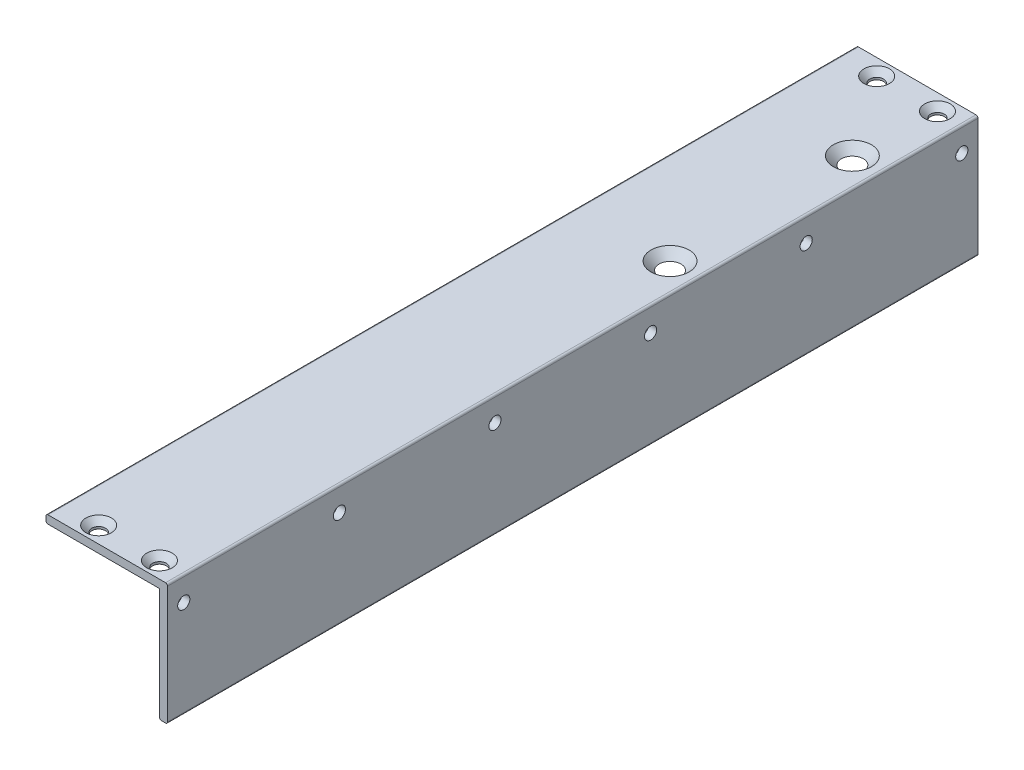
ISO-10303-21;
HEADER;
FILE_DESCRIPTION(('STEP AP214'),'2;1');
FILE_NAME('part.step','',(''),(''),'','','');
FILE_SCHEMA(('AUTOMOTIVE_DESIGN { 1 0 10303 214 1 1 1 1 }'));
ENDSEC;
DATA;
#1=APPLICATION_CONTEXT('core data for automotive mechanical design processes');
#2=APPLICATION_PROTOCOL_DEFINITION('international standard','automotive_design',2000,#1);
#3=PRODUCT_CONTEXT('',#1,'mechanical');
#4=PRODUCT('Part','Part','',(#3));
#5=PRODUCT_RELATED_PRODUCT_CATEGORY('part','',(#4));
#6=PRODUCT_DEFINITION_FORMATION('','',#4);
#7=PRODUCT_DEFINITION_CONTEXT('part definition',#1,'design');
#8=PRODUCT_DEFINITION('design','',#6,#7);
#9=PRODUCT_DEFINITION_SHAPE('','',#8);
#10=(LENGTH_UNIT() NAMED_UNIT(*) SI_UNIT(.MILLI.,.METRE.));
#11=(NAMED_UNIT(*) PLANE_ANGLE_UNIT() SI_UNIT($,.RADIAN.));
#12=(NAMED_UNIT(*) SI_UNIT($,.STERADIAN.) SOLID_ANGLE_UNIT());
#13=UNCERTAINTY_MEASURE_WITH_UNIT(LENGTH_MEASURE(1.E-05),#10,'distance_accuracy_value','');
#14=(GEOMETRIC_REPRESENTATION_CONTEXT(3) GLOBAL_UNCERTAINTY_ASSIGNED_CONTEXT((#13)) GLOBAL_UNIT_ASSIGNED_CONTEXT((#10,
#11,#12)) REPRESENTATION_CONTEXT('',''));
#15=CARTESIAN_POINT('',(0.,0.,0.));
#16=DIRECTION('',(0.,0.,1.));
#17=DIRECTION('',(1.,0.,0.));
#18=AXIS2_PLACEMENT_3D('',#15,#16,#17);
#19=CARTESIAN_POINT('',(2.,30.,200.));
#20=DIRECTION('',(-1.,0.,0.));
#21=DIRECTION('',(0.,-1.,0.));
#22=AXIS2_PLACEMENT_3D('',#19,#20,#21);
#23=PLANE('',#22);
#24=CARTESIAN_POINT('',(2.,24.,157.6));
#25=DIRECTION('',(1.,0.,0.));
#26=DIRECTION('',(0.,0.,-1.));
#27=AXIS2_PLACEMENT_3D('',#24,#25,#26);
#28=CIRCLE('',#27,1.49999999999999);
#29=CARTESIAN_POINT('',(2.,24.,156.1));
#30=VERTEX_POINT('',#29);
#31=EDGE_CURVE('E281',#30,#30,#28,.T.);
#32=ORIENTED_EDGE('',*,*,#31,.F.);
#33=EDGE_LOOP('',(#32));
#34=FACE_BOUND('',#33,.T.);
#35=CARTESIAN_POINT('',(2.,24.,80.8));
#36=DIRECTION('',(1.,0.,0.));
#37=DIRECTION('',(0.,0.,-1.));
#38=AXIS2_PLACEMENT_3D('',#35,#36,#37);
#39=CIRCLE('',#38,1.49999999999999);
#40=CARTESIAN_POINT('',(2.,24.,79.3));
#41=VERTEX_POINT('',#40);
#42=EDGE_CURVE('E269',#41,#41,#39,.T.);
#43=ORIENTED_EDGE('',*,*,#42,.F.);
#44=EDGE_LOOP('',(#43));
#45=FACE_BOUND('',#44,.T.);
#46=CARTESIAN_POINT('',(2.,24.,4.));
#47=DIRECTION('',(1.,0.,0.));
#48=DIRECTION('',(0.,0.,-1.));
#49=AXIS2_PLACEMENT_3D('',#46,#47,#48);
#50=CIRCLE('',#49,1.49999999999999);
#51=CARTESIAN_POINT('',(2.,24.,2.50000000000001));
#52=VERTEX_POINT('',#51);
#53=EDGE_CURVE('E257',#52,#52,#50,.T.);
#54=ORIENTED_EDGE('',*,*,#53,.F.);
#55=EDGE_LOOP('',(#54));
#56=FACE_BOUND('',#55,.T.);
#57=DIRECTION('',(0.,1.,0.));
#58=VECTOR('',#57,1.);
#59=CARTESIAN_POINT('',(2.,30.,200.));
#60=LINE('',#59,#58);
#61=CARTESIAN_POINT('',(2.,0.5,200.));
#62=VERTEX_POINT('',#61);
#63=CARTESIAN_POINT('',(2.,29.5,200.));
#64=VERTEX_POINT('',#63);
#65=EDGE_CURVE('E141',#62,#64,#60,.T.);
#66=ORIENTED_EDGE('',*,*,#65,.F.);
#67=DIRECTION('',(0.,0.,-1.));
#68=VECTOR('',#67,1.);
#69=CARTESIAN_POINT('',(2.,0.5,200.));
#70=LINE('',#69,#68);
#71=CARTESIAN_POINT('',(2.,0.5,0.));
#72=VERTEX_POINT('',#71);
#73=EDGE_CURVE('E181',#62,#72,#70,.T.);
#74=ORIENTED_EDGE('',*,*,#73,.T.);
#75=DIRECTION('',(0.,1.,0.));
#76=VECTOR('',#75,1.);
#77=CARTESIAN_POINT('',(2.,30.,0.));
#78=LINE('',#77,#76);
#79=CARTESIAN_POINT('',(2.,29.5,0.));
#80=VERTEX_POINT('',#79);
#81=EDGE_CURVE('E198',#72,#80,#78,.T.);
#82=ORIENTED_EDGE('',*,*,#81,.T.);
#83=DIRECTION('',(0.,0.,-1.));
#84=VECTOR('',#83,1.);
#85=CARTESIAN_POINT('',(2.,29.5,200.));
#86=LINE('',#85,#84);
#87=EDGE_CURVE('E179',#80,#64,#86,.F.);
#88=ORIENTED_EDGE('',*,*,#87,.T.);
#89=EDGE_LOOP('',(#66,#74,#82,#88));
#90=FACE_BOUND('',#89,.T.);
#91=CARTESIAN_POINT('',(2.,24.,42.4));
#92=DIRECTION('',(1.,0.,0.));
#93=DIRECTION('',(0.,0.,-1.));
#94=AXIS2_PLACEMENT_3D('',#91,#92,#93);
#95=CIRCLE('',#94,1.49999999999999);
#96=CARTESIAN_POINT('',(2.,24.,40.9));
#97=VERTEX_POINT('',#96);
#98=EDGE_CURVE('E263',#97,#97,#95,.T.);
#99=ORIENTED_EDGE('',*,*,#98,.F.);
#100=EDGE_LOOP('',(#99));
#101=FACE_BOUND('',#100,.T.);
#102=CARTESIAN_POINT('',(2.,24.,119.2));
#103=DIRECTION('',(1.,0.,0.));
#104=DIRECTION('',(0.,0.,-1.));
#105=AXIS2_PLACEMENT_3D('',#102,#103,#104);
#106=CIRCLE('',#105,1.49999999999999);
#107=CARTESIAN_POINT('',(2.,24.,117.7));
#108=VERTEX_POINT('',#107);
#109=EDGE_CURVE('E275',#108,#108,#106,.T.);
#110=ORIENTED_EDGE('',*,*,#109,.F.);
#111=EDGE_LOOP('',(#110));
#112=FACE_BOUND('',#111,.T.);
#113=CARTESIAN_POINT('',(2.,24.,196.));
#114=DIRECTION('',(1.,0.,0.));
#115=DIRECTION('',(0.,0.,-1.));
#116=AXIS2_PLACEMENT_3D('',#113,#114,#115);
#117=CIRCLE('',#116,1.49999999999999);
#118=CARTESIAN_POINT('',(2.,24.,194.5));
#119=VERTEX_POINT('',#118);
#120=EDGE_CURVE('E287',#119,#119,#117,.T.);
#121=ORIENTED_EDGE('',*,*,#120,.F.);
#122=EDGE_LOOP('',(#121));
#123=FACE_BOUND('',#122,.T.);
#124=ADVANCED_FACE('F31',(#34,#45,#56,#90,#101,#112,#123),#23,.F.);
#125=CARTESIAN_POINT('',(-28.,30.,200.));
#126=DIRECTION('',(0.,-1.,0.));
#127=DIRECTION('',(1.,0.,0.));
#128=AXIS2_PLACEMENT_3D('',#125,#126,#127);
#129=PLANE('',#128);
#130=CARTESIAN_POINT('',(-4.,30.,196.));
#131=DIRECTION('',(0.,1.,0.));
#132=DIRECTION('',(0.,0.,1.));
#133=AXIS2_PLACEMENT_3D('',#130,#131,#132);
#134=CIRCLE('',#133,3.15);
#135=CARTESIAN_POINT('',(-4.,30.,199.15));
#136=VERTEX_POINT('',#135);
#137=EDGE_CURVE('E242',#136,#136,#134,.T.);
#138=ORIENTED_EDGE('',*,*,#137,.F.);
#139=EDGE_LOOP('',(#138));
#140=FACE_BOUND('',#139,.T.);
#141=CARTESIAN_POINT('',(-4.,30.,4.));
#142=DIRECTION('',(0.,1.,0.));
#143=DIRECTION('',(0.,0.,1.));
#144=AXIS2_PLACEMENT_3D('',#141,#142,#143);
#145=CIRCLE('',#144,3.15);
#146=CARTESIAN_POINT('',(-4.,30.,7.15));
#147=VERTEX_POINT('',#146);
#148=EDGE_CURVE('E224',#147,#147,#145,.T.);
#149=ORIENTED_EDGE('',*,*,#148,.F.);
#150=EDGE_LOOP('',(#149));
#151=FACE_BOUND('',#150,.T.);
#152=CARTESIAN_POINT('',(-5.,30.,24.));
#153=DIRECTION('',(0.,1.,0.));
#154=DIRECTION('',(0.,0.,1.));
#155=AXIS2_PLACEMENT_3D('',#152,#153,#154);
#156=CIRCLE('',#155,4.7);
#157=CARTESIAN_POINT('',(-5.,30.,28.7));
#158=VERTEX_POINT('',#157);
#159=EDGE_CURVE('E209',#158,#158,#156,.T.);
#160=ORIENTED_EDGE('',*,*,#159,.F.);
#161=EDGE_LOOP('',(#160));
#162=FACE_BOUND('',#161,.T.);
#163=DIRECTION('',(-1.,0.,0.));
#164=VECTOR('',#163,1.);
#165=CARTESIAN_POINT('',(-28.,30.,200.));
#166=LINE('',#165,#164);
#167=CARTESIAN_POINT('',(1.5,30.,200.));
#168=VERTEX_POINT('',#167);
#169=CARTESIAN_POINT('',(-27.5,30.,200.));
#170=VERTEX_POINT('',#169);
#171=EDGE_CURVE('E147',#168,#170,#166,.T.);
#172=ORIENTED_EDGE('',*,*,#171,.F.);
#173=DIRECTION('',(0.,0.,-1.));
#174=VECTOR('',#173,1.);
#175=CARTESIAN_POINT('',(1.5,30.,200.));
#176=LINE('',#175,#174);
#177=CARTESIAN_POINT('',(1.5,30.,0.));
#178=VERTEX_POINT('',#177);
#179=EDGE_CURVE('E186',#168,#178,#176,.T.);
#180=ORIENTED_EDGE('',*,*,#179,.T.);
#181=DIRECTION('',(-1.,0.,0.));
#182=VECTOR('',#181,1.);
#183=CARTESIAN_POINT('',(-28.,30.,0.));
#184=LINE('',#183,#182);
#185=CARTESIAN_POINT('',(-27.5,30.,0.));
#186=VERTEX_POINT('',#185);
#187=EDGE_CURVE('E197',#178,#186,#184,.T.);
#188=ORIENTED_EDGE('',*,*,#187,.T.);
#189=DIRECTION('',(0.,0.,-1.));
#190=VECTOR('',#189,1.);
#191=CARTESIAN_POINT('',(-27.5,30.,200.));
#192=LINE('',#191,#190);
#193=EDGE_CURVE('E184',#186,#170,#192,.F.);
#194=ORIENTED_EDGE('',*,*,#193,.T.);
#195=EDGE_LOOP('',(#172,#180,#188,#194));
#196=FACE_BOUND('',#195,.T.);
#197=CARTESIAN_POINT('',(-5.,30.,69.));
#198=DIRECTION('',(0.,1.,0.));
#199=DIRECTION('',(0.,0.,1.));
#200=AXIS2_PLACEMENT_3D('',#197,#198,#199);
#201=CIRCLE('',#200,4.7);
#202=CARTESIAN_POINT('',(-5.,30.,73.7));
#203=VERTEX_POINT('',#202);
#204=EDGE_CURVE('E215',#203,#203,#201,.T.);
#205=ORIENTED_EDGE('',*,*,#204,.F.);
#206=EDGE_LOOP('',(#205));
#207=FACE_BOUND('',#206,.T.);
#208=CARTESIAN_POINT('',(-19.,30.,4.));
#209=DIRECTION('',(0.,1.,0.));
#210=DIRECTION('',(0.,0.,1.));
#211=AXIS2_PLACEMENT_3D('',#208,#209,#210);
#212=CIRCLE('',#211,3.15);
#213=CARTESIAN_POINT('',(-19.,30.,7.15));
#214=VERTEX_POINT('',#213);
#215=EDGE_CURVE('E233',#214,#214,#212,.T.);
#216=ORIENTED_EDGE('',*,*,#215,.F.);
#217=EDGE_LOOP('',(#216));
#218=FACE_BOUND('',#217,.T.);
#219=CARTESIAN_POINT('',(-19.,30.,196.));
#220=DIRECTION('',(0.,1.,0.));
#221=DIRECTION('',(0.,0.,1.));
#222=AXIS2_PLACEMENT_3D('',#219,#220,#221);
#223=CIRCLE('',#222,3.15);
#224=CARTESIAN_POINT('',(-19.,30.,199.15));
#225=VERTEX_POINT('',#224);
#226=EDGE_CURVE('E251',#225,#225,#223,.T.);
#227=ORIENTED_EDGE('',*,*,#226,.F.);
#228=EDGE_LOOP('',(#227));
#229=FACE_BOUND('',#228,.T.);
#230=ADVANCED_FACE('F294',(#140,#151,#162,#196,#207,#218,#229),#129,.F.);
#231=CARTESIAN_POINT('',(2.,0.,200.));
#232=DIRECTION('',(0.,1.,0.));
#233=DIRECTION('',(-1.,0.,0.));
#234=AXIS2_PLACEMENT_3D('',#231,#232,#233);
#235=PLANE('',#234);
#236=DIRECTION('',(1.,0.,0.));
#237=VECTOR('',#236,1.);
#238=CARTESIAN_POINT('',(2.,0.,200.));
#239=LINE('',#238,#237);
#240=CARTESIAN_POINT('',(0.5,0.,200.));
#241=VERTEX_POINT('',#240);
#242=CARTESIAN_POINT('',(1.5,0.,200.));
#243=VERTEX_POINT('',#242);
#244=EDGE_CURVE('E138',#241,#243,#239,.T.);
#245=ORIENTED_EDGE('',*,*,#244,.F.);
#246=DIRECTION('',(0.,0.,-1.));
#247=VECTOR('',#246,1.);
#248=CARTESIAN_POINT('',(0.5,0.,200.));
#249=LINE('',#248,#247);
#250=CARTESIAN_POINT('',(0.5,0.,0.));
#251=VERTEX_POINT('',#250);
#252=EDGE_CURVE('E156',#241,#251,#249,.T.);
#253=ORIENTED_EDGE('',*,*,#252,.T.);
#254=DIRECTION('',(1.,0.,0.));
#255=VECTOR('',#254,1.);
#256=CARTESIAN_POINT('',(2.,0.,0.));
#257=LINE('',#256,#255);
#258=CARTESIAN_POINT('',(1.5,0.,0.));
#259=VERTEX_POINT('',#258);
#260=EDGE_CURVE('E203',#251,#259,#257,.T.);
#261=ORIENTED_EDGE('',*,*,#260,.T.);
#262=DIRECTION('',(0.,0.,-1.));
#263=VECTOR('',#262,1.);
#264=CARTESIAN_POINT('',(1.5,0.,200.));
#265=LINE('',#264,#263);
#266=EDGE_CURVE('E133',#259,#243,#265,.F.);
#267=ORIENTED_EDGE('',*,*,#266,.T.);
#268=EDGE_LOOP('',(#245,#253,#261,#267));
#269=FACE_BOUND('',#268,.T.);
#270=ADVANCED_FACE('F33',(#269),#235,.F.);
#271=CARTESIAN_POINT('',(-28.,28.,200.));
#272=DIRECTION('',(1.,0.,0.));
#273=DIRECTION('',(0.,0.,-1.));
#274=AXIS2_PLACEMENT_3D('',#271,#272,#273);
#275=PLANE('',#274);
#276=DIRECTION('',(0.,-1.,0.));
#277=VECTOR('',#276,1.);
#278=CARTESIAN_POINT('',(-28.,28.,200.));
#279=LINE('',#278,#277);
#280=CARTESIAN_POINT('',(-28.,29.5,200.));
#281=VERTEX_POINT('',#280);
#282=CARTESIAN_POINT('',(-28.,28.5,200.));
#283=VERTEX_POINT('',#282);
#284=EDGE_CURVE('E150',#281,#283,#279,.T.);
#285=ORIENTED_EDGE('',*,*,#284,.F.);
#286=DIRECTION('',(0.,0.,-1.));
#287=VECTOR('',#286,1.);
#288=CARTESIAN_POINT('',(-28.,29.5,200.));
#289=LINE('',#288,#287);
#290=CARTESIAN_POINT('',(-28.,29.5,0.));
#291=VERTEX_POINT('',#290);
#292=EDGE_CURVE('E39',#281,#291,#289,.T.);
#293=ORIENTED_EDGE('',*,*,#292,.T.);
#294=DIRECTION('',(0.,-1.,0.));
#295=VECTOR('',#294,1.);
#296=CARTESIAN_POINT('',(-28.,28.,0.));
#297=LINE('',#296,#295);
#298=CARTESIAN_POINT('',(-28.,28.5,0.));
#299=VERTEX_POINT('',#298);
#300=EDGE_CURVE('E125',#291,#299,#297,.T.);
#301=ORIENTED_EDGE('',*,*,#300,.T.);
#302=DIRECTION('',(0.,0.,-1.));
#303=VECTOR('',#302,1.);
#304=CARTESIAN_POINT('',(-28.,28.5,200.));
#305=LINE('',#304,#303);
#306=EDGE_CURVE('E54',#299,#283,#305,.F.);
#307=ORIENTED_EDGE('',*,*,#306,.T.);
#308=EDGE_LOOP('',(#285,#293,#301,#307));
#309=FACE_BOUND('',#308,.T.);
#310=ADVANCED_FACE('F192',(#309),#275,.F.);
#311=CARTESIAN_POINT('',(0.,28.,200.));
#312=DIRECTION('',(0.,1.,0.));
#313=DIRECTION('',(-1.,0.,0.));
#314=AXIS2_PLACEMENT_3D('',#311,#312,#313);
#315=PLANE('',#314);
#316=CARTESIAN_POINT('',(-19.,28.,196.));
#317=DIRECTION('',(0.,1.,0.));
#318=DIRECTION('',(-1.,0.,0.));
#319=AXIS2_PLACEMENT_3D('',#316,#317,#318);
#320=CIRCLE('',#319,1.69999999999999);
#321=CARTESIAN_POINT('',(-20.7,28.,196.));
#322=VERTEX_POINT('',#321);
#323=EDGE_CURVE('E245',#322,#322,#320,.T.);
#324=ORIENTED_EDGE('',*,*,#323,.T.);
#325=EDGE_LOOP('',(#324));
#326=FACE_BOUND('',#325,.T.);
#327=CARTESIAN_POINT('',(-4.,28.,196.));
#328=DIRECTION('',(0.,1.,0.));
#329=DIRECTION('',(-1.,0.,0.));
#330=AXIS2_PLACEMENT_3D('',#327,#328,#329);
#331=CIRCLE('',#330,1.69999999999999);
#332=CARTESIAN_POINT('',(-5.7,28.,196.));
#333=VERTEX_POINT('',#332);
#334=EDGE_CURVE('E236',#333,#333,#331,.T.);
#335=ORIENTED_EDGE('',*,*,#334,.T.);
#336=EDGE_LOOP('',(#335));
#337=FACE_BOUND('',#336,.T.);
#338=CARTESIAN_POINT('',(-19.,28.,4.));
#339=DIRECTION('',(0.,1.,0.));
#340=DIRECTION('',(-1.,0.,0.));
#341=AXIS2_PLACEMENT_3D('',#338,#339,#340);
#342=CIRCLE('',#341,1.7);
#343=CARTESIAN_POINT('',(-20.7,28.,4.));
#344=VERTEX_POINT('',#343);
#345=EDGE_CURVE('E227',#344,#344,#342,.T.);
#346=ORIENTED_EDGE('',*,*,#345,.T.);
#347=EDGE_LOOP('',(#346));
#348=FACE_BOUND('',#347,.T.);
#349=CARTESIAN_POINT('',(-4.,28.,4.));
#350=DIRECTION('',(0.,1.,0.));
#351=DIRECTION('',(-1.,0.,0.));
#352=AXIS2_PLACEMENT_3D('',#349,#350,#351);
#353=CIRCLE('',#352,1.7);
#354=CARTESIAN_POINT('',(-5.7,28.,4.));
#355=VERTEX_POINT('',#354);
#356=EDGE_CURVE('E218',#355,#355,#353,.T.);
#357=ORIENTED_EDGE('',*,*,#356,.T.);
#358=EDGE_LOOP('',(#357));
#359=FACE_BOUND('',#358,.T.);
#360=CARTESIAN_POINT('',(-5.,28.,69.));
#361=DIRECTION('',(0.,1.,0.));
#362=DIRECTION('',(-1.,0.,0.));
#363=AXIS2_PLACEMENT_3D('',#360,#361,#362);
#364=CIRCLE('',#363,2.7);
#365=CARTESIAN_POINT('',(-7.70000000000001,28.,69.));
#366=VERTEX_POINT('',#365);
#367=EDGE_CURVE('E212',#366,#366,#364,.T.);
#368=ORIENTED_EDGE('',*,*,#367,.T.);
#369=EDGE_LOOP('',(#368));
#370=FACE_BOUND('',#369,.T.);
#371=CARTESIAN_POINT('',(-5.,28.,24.));
#372=DIRECTION('',(0.,1.,0.));
#373=DIRECTION('',(-1.,0.,0.));
#374=AXIS2_PLACEMENT_3D('',#371,#372,#373);
#375=CIRCLE('',#374,2.7);
#376=CARTESIAN_POINT('',(-7.70000000000001,28.,24.));
#377=VERTEX_POINT('',#376);
#378=EDGE_CURVE('E206',#377,#377,#375,.T.);
#379=ORIENTED_EDGE('',*,*,#378,.T.);
#380=EDGE_LOOP('',(#379));
#381=FACE_BOUND('',#380,.T.);
#382=DIRECTION('',(1.,0.,0.));
#383=VECTOR('',#382,1.);
#384=CARTESIAN_POINT('',(0.,28.,200.));
#385=LINE('',#384,#383);
#386=CARTESIAN_POINT('',(-27.5,28.,200.));
#387=VERTEX_POINT('',#386);
#388=CARTESIAN_POINT('',(0.,28.,200.));
#389=VERTEX_POINT('',#388);
#390=EDGE_CURVE('E152',#387,#389,#385,.T.);
#391=ORIENTED_EDGE('',*,*,#390,.F.);
#392=DIRECTION('',(0.,0.,-1.));
#393=VECTOR('',#392,1.);
#394=CARTESIAN_POINT('',(-27.5,28.,200.));
#395=LINE('',#394,#393);
#396=CARTESIAN_POINT('',(-27.5,28.,0.));
#397=VERTEX_POINT('',#396);
#398=EDGE_CURVE('E11',#387,#397,#395,.T.);
#399=ORIENTED_EDGE('',*,*,#398,.T.);
#400=DIRECTION('',(1.,0.,0.));
#401=VECTOR('',#400,1.);
#402=CARTESIAN_POINT('',(0.,28.,0.));
#403=LINE('',#402,#401);
#404=CARTESIAN_POINT('',(0.,28.,0.));
#405=VERTEX_POINT('',#404);
#406=EDGE_CURVE('E116',#397,#405,#403,.T.);
#407=ORIENTED_EDGE('',*,*,#406,.T.);
#408=DIRECTION('',(0.,0.,-1.));
#409=VECTOR('',#408,1.);
#410=CARTESIAN_POINT('',(0.,28.,200.));
#411=LINE('',#410,#409);
#412=EDGE_CURVE('E119',#389,#405,#411,.T.);
#413=ORIENTED_EDGE('',*,*,#412,.F.);
#414=EDGE_LOOP('',(#391,#399,#407,#413));
#415=FACE_BOUND('',#414,.T.);
#416=ADVANCED_FACE('F118',(#326,#337,#348,#359,#370,#381,#415),#315,.F.);
#417=CARTESIAN_POINT('',(0.,0.,200.));
#418=DIRECTION('',(1.,0.,0.));
#419=DIRECTION('',(0.,1.,0.));
#420=AXIS2_PLACEMENT_3D('',#417,#418,#419);
#421=PLANE('',#420);
#422=CARTESIAN_POINT('',(0.,24.,196.));
#423=DIRECTION('',(1.,0.,0.));
#424=DIRECTION('',(0.,1.,0.));
#425=AXIS2_PLACEMENT_3D('',#422,#423,#424);
#426=CIRCLE('',#425,1.49999999999999);
#427=CARTESIAN_POINT('',(0.,25.5,196.));
#428=VERTEX_POINT('',#427);
#429=EDGE_CURVE('E284',#428,#428,#426,.T.);
#430=ORIENTED_EDGE('',*,*,#429,.T.);
#431=EDGE_LOOP('',(#430));
#432=FACE_BOUND('',#431,.T.);
#433=CARTESIAN_POINT('',(0.,24.,157.6));
#434=DIRECTION('',(1.,0.,0.));
#435=DIRECTION('',(0.,1.,0.));
#436=AXIS2_PLACEMENT_3D('',#433,#434,#435);
#437=CIRCLE('',#436,1.49999999999999);
#438=CARTESIAN_POINT('',(0.,25.5,157.6));
#439=VERTEX_POINT('',#438);
#440=EDGE_CURVE('E278',#439,#439,#437,.T.);
#441=ORIENTED_EDGE('',*,*,#440,.T.);
#442=EDGE_LOOP('',(#441));
#443=FACE_BOUND('',#442,.T.);
#444=CARTESIAN_POINT('',(0.,24.,119.2));
#445=DIRECTION('',(1.,0.,0.));
#446=DIRECTION('',(0.,1.,0.));
#447=AXIS2_PLACEMENT_3D('',#444,#445,#446);
#448=CIRCLE('',#447,1.49999999999999);
#449=CARTESIAN_POINT('',(0.,25.5,119.2));
#450=VERTEX_POINT('',#449);
#451=EDGE_CURVE('E272',#450,#450,#448,.T.);
#452=ORIENTED_EDGE('',*,*,#451,.T.);
#453=EDGE_LOOP('',(#452));
#454=FACE_BOUND('',#453,.T.);
#455=CARTESIAN_POINT('',(0.,24.,80.8));
#456=DIRECTION('',(1.,0.,0.));
#457=DIRECTION('',(0.,1.,0.));
#458=AXIS2_PLACEMENT_3D('',#455,#456,#457);
#459=CIRCLE('',#458,1.49999999999999);
#460=CARTESIAN_POINT('',(0.,25.5,80.8));
#461=VERTEX_POINT('',#460);
#462=EDGE_CURVE('E266',#461,#461,#459,.T.);
#463=ORIENTED_EDGE('',*,*,#462,.T.);
#464=EDGE_LOOP('',(#463));
#465=FACE_BOUND('',#464,.T.);
#466=CARTESIAN_POINT('',(0.,24.,42.4));
#467=DIRECTION('',(1.,0.,0.));
#468=DIRECTION('',(0.,1.,0.));
#469=AXIS2_PLACEMENT_3D('',#466,#467,#468);
#470=CIRCLE('',#469,1.49999999999999);
#471=CARTESIAN_POINT('',(0.,25.5,42.4));
#472=VERTEX_POINT('',#471);
#473=EDGE_CURVE('E260',#472,#472,#470,.T.);
#474=ORIENTED_EDGE('',*,*,#473,.T.);
#475=EDGE_LOOP('',(#474));
#476=FACE_BOUND('',#475,.T.);
#477=CARTESIAN_POINT('',(0.,24.,4.));
#478=DIRECTION('',(1.,0.,0.));
#479=DIRECTION('',(0.,1.,0.));
#480=AXIS2_PLACEMENT_3D('',#477,#478,#479);
#481=CIRCLE('',#480,1.49999999999999);
#482=CARTESIAN_POINT('',(0.,25.5,4.));
#483=VERTEX_POINT('',#482);
#484=EDGE_CURVE('E254',#483,#483,#481,.T.);
#485=ORIENTED_EDGE('',*,*,#484,.T.);
#486=EDGE_LOOP('',(#485));
#487=FACE_BOUND('',#486,.T.);
#488=DIRECTION('',(0.,-1.,0.));
#489=VECTOR('',#488,1.);
#490=CARTESIAN_POINT('',(0.,0.,0.));
#491=LINE('',#490,#489);
#492=CARTESIAN_POINT('',(0.,0.5,0.));
#493=VERTEX_POINT('',#492);
#494=EDGE_CURVE('E124',#405,#493,#491,.T.);
#495=ORIENTED_EDGE('',*,*,#494,.T.);
#496=DIRECTION('',(0.,0.,-1.));
#497=VECTOR('',#496,1.);
#498=CARTESIAN_POINT('',(0.,0.5,200.));
#499=LINE('',#498,#497);
#500=CARTESIAN_POINT('',(0.,0.5,200.));
#501=VERTEX_POINT('',#500);
#502=EDGE_CURVE('E168',#493,#501,#499,.F.);
#503=ORIENTED_EDGE('',*,*,#502,.T.);
#504=DIRECTION('',(0.,-1.,0.));
#505=VECTOR('',#504,1.);
#506=CARTESIAN_POINT('',(0.,0.,200.));
#507=LINE('',#506,#505);
#508=EDGE_CURVE('E132',#389,#501,#507,.T.);
#509=ORIENTED_EDGE('',*,*,#508,.F.);
#510=ORIENTED_EDGE('',*,*,#412,.T.);
#511=EDGE_LOOP('',(#495,#503,#509,#510));
#512=FACE_BOUND('',#511,.T.);
#513=ADVANCED_FACE('F129',(#432,#443,#454,#465,#476,#487,#512),#421,.F.);
#514=CARTESIAN_POINT('',(0.,0.,200.));
#515=DIRECTION('',(0.,0.,-1.));
#516=DIRECTION('',(-1.,0.,0.));
#517=AXIS2_PLACEMENT_3D('',#514,#515,#516);
#518=PLANE('',#517);
#519=ORIENTED_EDGE('',*,*,#508,.T.);
#520=CARTESIAN_POINT('',(0.5,0.5,200.));
#521=DIRECTION('',(0.,0.,-1.));
#522=DIRECTION('',(-1.,0.,0.));
#523=AXIS2_PLACEMENT_3D('',#520,#521,#522);
#524=CIRCLE('',#523,0.5);
#525=EDGE_CURVE('E177',#501,#241,#524,.F.);
#526=ORIENTED_EDGE('',*,*,#525,.T.);
#527=ORIENTED_EDGE('',*,*,#244,.T.);
#528=CARTESIAN_POINT('',(1.5,0.5,200.));
#529=DIRECTION('',(0.,0.,-1.));
#530=DIRECTION('',(-1.,0.,0.));
#531=AXIS2_PLACEMENT_3D('',#528,#529,#530);
#532=CIRCLE('',#531,0.5);
#533=EDGE_CURVE('E175',#243,#62,#532,.F.);
#534=ORIENTED_EDGE('',*,*,#533,.T.);
#535=ORIENTED_EDGE('',*,*,#65,.T.);
#536=CARTESIAN_POINT('',(1.5,29.5,200.));
#537=DIRECTION('',(0.,0.,-1.));
#538=DIRECTION('',(-1.,0.,0.));
#539=AXIS2_PLACEMENT_3D('',#536,#537,#538);
#540=CIRCLE('',#539,0.5);
#541=EDGE_CURVE('E173',#64,#168,#540,.F.);
#542=ORIENTED_EDGE('',*,*,#541,.T.);
#543=ORIENTED_EDGE('',*,*,#171,.T.);
#544=CARTESIAN_POINT('',(-27.5,29.5,200.));
#545=DIRECTION('',(0.,0.,-1.));
#546=DIRECTION('',(-1.,0.,0.));
#547=AXIS2_PLACEMENT_3D('',#544,#545,#546);
#548=CIRCLE('',#547,0.5);
#549=EDGE_CURVE('E171',#170,#281,#548,.F.);
#550=ORIENTED_EDGE('',*,*,#549,.T.);
#551=ORIENTED_EDGE('',*,*,#284,.T.);
#552=CARTESIAN_POINT('',(-27.5,28.5,200.));
#553=DIRECTION('',(0.,0.,-1.));
#554=DIRECTION('',(-1.,0.,0.));
#555=AXIS2_PLACEMENT_3D('',#552,#553,#554);
#556=CIRCLE('',#555,0.5);
#557=EDGE_CURVE('E46',#283,#387,#556,.F.);
#558=ORIENTED_EDGE('',*,*,#557,.T.);
#559=ORIENTED_EDGE('',*,*,#390,.T.);
#560=EDGE_LOOP('',(#519,#526,#527,#534,#535,#542,#543,#550,#551,#558,#559));
#561=FACE_BOUND('',#560,.T.);
#562=ADVANCED_FACE('F311',(#561),#518,.F.);
#563=CARTESIAN_POINT('',(0.,0.,0.));
#564=DIRECTION('',(0.,0.,-1.));
#565=DIRECTION('',(-1.,0.,0.));
#566=AXIS2_PLACEMENT_3D('',#563,#564,#565);
#567=PLANE('',#566);
#568=ORIENTED_EDGE('',*,*,#260,.F.);
#569=CARTESIAN_POINT('',(0.5,0.5,0.));
#570=DIRECTION('',(0.,0.,-1.));
#571=DIRECTION('',(-1.,0.,0.));
#572=AXIS2_PLACEMENT_3D('',#569,#570,#571);
#573=CIRCLE('',#572,0.5);
#574=EDGE_CURVE('E137',#251,#493,#573,.T.);
#575=ORIENTED_EDGE('',*,*,#574,.T.);
#576=ORIENTED_EDGE('',*,*,#494,.F.);
#577=ORIENTED_EDGE('',*,*,#406,.F.);
#578=CARTESIAN_POINT('',(-27.5,28.5,0.));
#579=DIRECTION('',(0.,0.,-1.));
#580=DIRECTION('',(-1.,0.,0.));
#581=AXIS2_PLACEMENT_3D('',#578,#579,#580);
#582=CIRCLE('',#581,0.5);
#583=EDGE_CURVE('E159',#397,#299,#582,.T.);
#584=ORIENTED_EDGE('',*,*,#583,.T.);
#585=ORIENTED_EDGE('',*,*,#300,.F.);
#586=CARTESIAN_POINT('',(-27.5,29.5,0.));
#587=DIRECTION('',(0.,0.,-1.));
#588=DIRECTION('',(-1.,0.,0.));
#589=AXIS2_PLACEMENT_3D('',#586,#587,#588);
#590=CIRCLE('',#589,0.5);
#591=EDGE_CURVE('E161',#291,#186,#590,.T.);
#592=ORIENTED_EDGE('',*,*,#591,.T.);
#593=ORIENTED_EDGE('',*,*,#187,.F.);
#594=CARTESIAN_POINT('',(1.5,29.5,0.));
#595=DIRECTION('',(0.,0.,-1.));
#596=DIRECTION('',(-1.,0.,0.));
#597=AXIS2_PLACEMENT_3D('',#594,#595,#596);
#598=CIRCLE('',#597,0.5);
#599=EDGE_CURVE('E163',#178,#80,#598,.T.);
#600=ORIENTED_EDGE('',*,*,#599,.T.);
#601=ORIENTED_EDGE('',*,*,#81,.F.);
#602=CARTESIAN_POINT('',(1.5,0.5,0.));
#603=DIRECTION('',(0.,0.,-1.));
#604=DIRECTION('',(-1.,0.,0.));
#605=AXIS2_PLACEMENT_3D('',#602,#603,#604);
#606=CIRCLE('',#605,0.5);
#607=EDGE_CURVE('E165',#72,#259,#606,.T.);
#608=ORIENTED_EDGE('',*,*,#607,.T.);
#609=EDGE_LOOP('',(#568,#575,#576,#577,#584,#585,#592,#593,#600,#601,#608));
#610=FACE_BOUND('',#609,.T.);
#611=ADVANCED_FACE('F136',(#610),#567,.T.);
#612=CARTESIAN_POINT('',(0.5,0.5,200.));
#613=DIRECTION('',(0.,0.,-1.));
#614=DIRECTION('',(-1.,0.,0.));
#615=AXIS2_PLACEMENT_3D('',#612,#613,#614);
#616=CYLINDRICAL_SURFACE('',#615,0.5);
#617=ORIENTED_EDGE('',*,*,#525,.F.);
#618=ORIENTED_EDGE('',*,*,#502,.F.);
#619=ORIENTED_EDGE('',*,*,#574,.F.);
#620=ORIENTED_EDGE('',*,*,#252,.F.);
#621=EDGE_LOOP('',(#617,#618,#619,#620));
#622=FACE_BOUND('',#621,.T.);
#623=ADVANCED_FACE('F317',(#622),#616,.T.);
#624=CARTESIAN_POINT('',(1.5,0.5,200.));
#625=DIRECTION('',(0.,0.,-1.));
#626=DIRECTION('',(-1.,0.,0.));
#627=AXIS2_PLACEMENT_3D('',#624,#625,#626);
#628=CYLINDRICAL_SURFACE('',#627,0.5);
#629=ORIENTED_EDGE('',*,*,#533,.F.);
#630=ORIENTED_EDGE('',*,*,#266,.F.);
#631=ORIENTED_EDGE('',*,*,#607,.F.);
#632=ORIENTED_EDGE('',*,*,#73,.F.);
#633=EDGE_LOOP('',(#629,#630,#631,#632));
#634=FACE_BOUND('',#633,.T.);
#635=ADVANCED_FACE('F320',(#634),#628,.T.);
#636=CARTESIAN_POINT('',(1.5,29.5,200.));
#637=DIRECTION('',(0.,0.,-1.));
#638=DIRECTION('',(-1.,0.,0.));
#639=AXIS2_PLACEMENT_3D('',#636,#637,#638);
#640=CYLINDRICAL_SURFACE('',#639,0.5);
#641=ORIENTED_EDGE('',*,*,#541,.F.);
#642=ORIENTED_EDGE('',*,*,#87,.F.);
#643=ORIENTED_EDGE('',*,*,#599,.F.);
#644=ORIENTED_EDGE('',*,*,#179,.F.);
#645=EDGE_LOOP('',(#641,#642,#643,#644));
#646=FACE_BOUND('',#645,.T.);
#647=ADVANCED_FACE('F324',(#646),#640,.T.);
#648=CARTESIAN_POINT('',(-27.5,29.5,200.));
#649=DIRECTION('',(0.,0.,-1.));
#650=DIRECTION('',(-1.,0.,0.));
#651=AXIS2_PLACEMENT_3D('',#648,#649,#650);
#652=CYLINDRICAL_SURFACE('',#651,0.5);
#653=ORIENTED_EDGE('',*,*,#549,.F.);
#654=ORIENTED_EDGE('',*,*,#193,.F.);
#655=ORIENTED_EDGE('',*,*,#591,.F.);
#656=ORIENTED_EDGE('',*,*,#292,.F.);
#657=EDGE_LOOP('',(#653,#654,#655,#656));
#658=FACE_BOUND('',#657,.T.);
#659=ADVANCED_FACE('F328',(#658),#652,.T.);
#660=CARTESIAN_POINT('',(-27.5,28.5,200.));
#661=DIRECTION('',(0.,0.,-1.));
#662=DIRECTION('',(-1.,0.,0.));
#663=AXIS2_PLACEMENT_3D('',#660,#661,#662);
#664=CYLINDRICAL_SURFACE('',#663,0.5);
#665=ORIENTED_EDGE('',*,*,#557,.F.);
#666=ORIENTED_EDGE('',*,*,#306,.F.);
#667=ORIENTED_EDGE('',*,*,#583,.F.);
#668=ORIENTED_EDGE('',*,*,#398,.F.);
#669=EDGE_LOOP('',(#665,#666,#667,#668));
#670=FACE_BOUND('',#669,.T.);
#671=ADVANCED_FACE('F332',(#670),#664,.T.);
#672=CARTESIAN_POINT('',(-5.,30.,24.));
#673=DIRECTION('',(0.,1.,0.));
#674=DIRECTION('',(0.,0.,1.));
#675=AXIS2_PLACEMENT_3D('',#672,#673,#674);
#676=CONICAL_SURFACE('',#675,4.7,0.785398163397449);
#677=ORIENTED_EDGE('',*,*,#378,.F.);
#678=EDGE_LOOP('',(#677));
#679=FACE_BOUND('',#678,.T.);
#680=ORIENTED_EDGE('',*,*,#159,.T.);
#681=EDGE_LOOP('',(#680));
#682=FACE_BOUND('',#681,.T.);
#683=ADVANCED_FACE('F335',(#679,#682),#676,.F.);
#684=CARTESIAN_POINT('',(-5.,30.,69.));
#685=DIRECTION('',(0.,1.,0.));
#686=DIRECTION('',(0.,0.,1.));
#687=AXIS2_PLACEMENT_3D('',#684,#685,#686);
#688=CONICAL_SURFACE('',#687,4.7,0.785398163397449);
#689=ORIENTED_EDGE('',*,*,#367,.F.);
#690=EDGE_LOOP('',(#689));
#691=FACE_BOUND('',#690,.T.);
#692=ORIENTED_EDGE('',*,*,#204,.T.);
#693=EDGE_LOOP('',(#692));
#694=FACE_BOUND('',#693,.T.);
#695=ADVANCED_FACE('F339',(#691,#694),#688,.F.);
#696=CARTESIAN_POINT('',(-4.,30.,4.));
#697=DIRECTION('',(0.,1.,0.));
#698=DIRECTION('',(0.,0.,1.));
#699=AXIS2_PLACEMENT_3D('',#696,#697,#698);
#700=CYLINDRICAL_SURFACE('',#699,1.7);
#701=ORIENTED_EDGE('',*,*,#356,.F.);
#702=EDGE_LOOP('',(#701));
#703=FACE_BOUND('',#702,.T.);
#704=CARTESIAN_POINT('',(-4.,28.55,4.));
#705=DIRECTION('',(0.,1.,0.));
#706=DIRECTION('',(0.,0.,1.));
#707=AXIS2_PLACEMENT_3D('',#704,#705,#706);
#708=CIRCLE('',#707,1.7);
#709=CARTESIAN_POINT('',(-4.,28.55,5.7));
#710=VERTEX_POINT('',#709);
#711=EDGE_CURVE('E221',#710,#710,#708,.T.);
#712=ORIENTED_EDGE('',*,*,#711,.T.);
#713=EDGE_LOOP('',(#712));
#714=FACE_BOUND('',#713,.T.);
#715=ADVANCED_FACE('F343',(#703,#714),#700,.F.);
#716=CARTESIAN_POINT('',(-4.,30.,4.));
#717=DIRECTION('',(0.,1.,0.));
#718=DIRECTION('',(0.,0.,1.));
#719=AXIS2_PLACEMENT_3D('',#716,#717,#718);
#720=CONICAL_SURFACE('',#719,3.15,0.785398163397449);
#721=ORIENTED_EDGE('',*,*,#711,.F.);
#722=EDGE_LOOP('',(#721));
#723=FACE_BOUND('',#722,.T.);
#724=ORIENTED_EDGE('',*,*,#148,.T.);
#725=EDGE_LOOP('',(#724));
#726=FACE_BOUND('',#725,.T.);
#727=ADVANCED_FACE('F347',(#723,#726),#720,.F.);
#728=CARTESIAN_POINT('',(-19.,30.,4.));
#729=DIRECTION('',(0.,1.,0.));
#730=DIRECTION('',(0.,0.,1.));
#731=AXIS2_PLACEMENT_3D('',#728,#729,#730);
#732=CYLINDRICAL_SURFACE('',#731,1.7);
#733=ORIENTED_EDGE('',*,*,#345,.F.);
#734=EDGE_LOOP('',(#733));
#735=FACE_BOUND('',#734,.T.);
#736=CARTESIAN_POINT('',(-19.,28.55,4.));
#737=DIRECTION('',(0.,1.,0.));
#738=DIRECTION('',(0.,0.,1.));
#739=AXIS2_PLACEMENT_3D('',#736,#737,#738);
#740=CIRCLE('',#739,1.7);
#741=CARTESIAN_POINT('',(-19.,28.55,5.7));
#742=VERTEX_POINT('',#741);
#743=EDGE_CURVE('E230',#742,#742,#740,.T.);
#744=ORIENTED_EDGE('',*,*,#743,.T.);
#745=EDGE_LOOP('',(#744));
#746=FACE_BOUND('',#745,.T.);
#747=ADVANCED_FACE('F351',(#735,#746),#732,.F.);
#748=CARTESIAN_POINT('',(-19.,30.,4.));
#749=DIRECTION('',(0.,1.,0.));
#750=DIRECTION('',(0.,0.,1.));
#751=AXIS2_PLACEMENT_3D('',#748,#749,#750);
#752=CONICAL_SURFACE('',#751,3.15,0.785398163397448);
#753=ORIENTED_EDGE('',*,*,#743,.F.);
#754=EDGE_LOOP('',(#753));
#755=FACE_BOUND('',#754,.T.);
#756=ORIENTED_EDGE('',*,*,#215,.T.);
#757=EDGE_LOOP('',(#756));
#758=FACE_BOUND('',#757,.T.);
#759=ADVANCED_FACE('F355',(#755,#758),#752,.F.);
#760=CARTESIAN_POINT('',(-4.,30.,196.));
#761=DIRECTION('',(0.,1.,0.));
#762=DIRECTION('',(0.,0.,1.));
#763=AXIS2_PLACEMENT_3D('',#760,#761,#762);
#764=CYLINDRICAL_SURFACE('',#763,1.69999999999999);
#765=ORIENTED_EDGE('',*,*,#334,.F.);
#766=EDGE_LOOP('',(#765));
#767=FACE_BOUND('',#766,.T.);
#768=CARTESIAN_POINT('',(-4.,28.55,196.));
#769=DIRECTION('',(0.,1.,0.));
#770=DIRECTION('',(0.,0.,1.));
#771=AXIS2_PLACEMENT_3D('',#768,#769,#770);
#772=CIRCLE('',#771,1.69999999999999);
#773=CARTESIAN_POINT('',(-4.,28.55,197.7));
#774=VERTEX_POINT('',#773);
#775=EDGE_CURVE('E239',#774,#774,#772,.T.);
#776=ORIENTED_EDGE('',*,*,#775,.T.);
#777=EDGE_LOOP('',(#776));
#778=FACE_BOUND('',#777,.T.);
#779=ADVANCED_FACE('F359',(#767,#778),#764,.F.);
#780=CARTESIAN_POINT('',(-4.,30.,196.));
#781=DIRECTION('',(0.,1.,0.));
#782=DIRECTION('',(0.,0.,1.));
#783=AXIS2_PLACEMENT_3D('',#780,#781,#782);
#784=CONICAL_SURFACE('',#783,3.15,0.78539816339745);
#785=ORIENTED_EDGE('',*,*,#775,.F.);
#786=EDGE_LOOP('',(#785));
#787=FACE_BOUND('',#786,.T.);
#788=ORIENTED_EDGE('',*,*,#137,.T.);
#789=EDGE_LOOP('',(#788));
#790=FACE_BOUND('',#789,.T.);
#791=ADVANCED_FACE('F363',(#787,#790),#784,.F.);
#792=CARTESIAN_POINT('',(-19.,30.,196.));
#793=DIRECTION('',(0.,1.,0.));
#794=DIRECTION('',(0.,0.,1.));
#795=AXIS2_PLACEMENT_3D('',#792,#793,#794);
#796=CYLINDRICAL_SURFACE('',#795,1.69999999999999);
#797=ORIENTED_EDGE('',*,*,#323,.F.);
#798=EDGE_LOOP('',(#797));
#799=FACE_BOUND('',#798,.T.);
#800=CARTESIAN_POINT('',(-19.,28.55,196.));
#801=DIRECTION('',(0.,1.,0.));
#802=DIRECTION('',(0.,0.,1.));
#803=AXIS2_PLACEMENT_3D('',#800,#801,#802);
#804=CIRCLE('',#803,1.69999999999999);
#805=CARTESIAN_POINT('',(-19.,28.55,197.7));
#806=VERTEX_POINT('',#805);
#807=EDGE_CURVE('E248',#806,#806,#804,.T.);
#808=ORIENTED_EDGE('',*,*,#807,.T.);
#809=EDGE_LOOP('',(#808));
#810=FACE_BOUND('',#809,.T.);
#811=ADVANCED_FACE('F367',(#799,#810),#796,.F.);
#812=CARTESIAN_POINT('',(-19.,30.,196.));
#813=DIRECTION('',(0.,1.,0.));
#814=DIRECTION('',(0.,0.,1.));
#815=AXIS2_PLACEMENT_3D('',#812,#813,#814);
#816=CONICAL_SURFACE('',#815,3.15,0.78539816339745);
#817=ORIENTED_EDGE('',*,*,#807,.F.);
#818=EDGE_LOOP('',(#817));
#819=FACE_BOUND('',#818,.T.);
#820=ORIENTED_EDGE('',*,*,#226,.T.);
#821=EDGE_LOOP('',(#820));
#822=FACE_BOUND('',#821,.T.);
#823=ADVANCED_FACE('F371',(#819,#822),#816,.F.);
#824=CARTESIAN_POINT('',(2.,24.,4.));
#825=DIRECTION('',(1.,0.,0.));
#826=DIRECTION('',(0.,0.,-1.));
#827=AXIS2_PLACEMENT_3D('',#824,#825,#826);
#828=CYLINDRICAL_SURFACE('',#827,1.49999999999999);
#829=ORIENTED_EDGE('',*,*,#484,.F.);
#830=EDGE_LOOP('',(#829));
#831=FACE_BOUND('',#830,.T.);
#832=ORIENTED_EDGE('',*,*,#53,.T.);
#833=EDGE_LOOP('',(#832));
#834=FACE_BOUND('',#833,.T.);
#835=ADVANCED_FACE('F375',(#831,#834),#828,.F.);
#836=CARTESIAN_POINT('',(2.,24.,42.4));
#837=DIRECTION('',(1.,0.,0.));
#838=DIRECTION('',(0.,0.,-1.));
#839=AXIS2_PLACEMENT_3D('',#836,#837,#838);
#840=CYLINDRICAL_SURFACE('',#839,1.49999999999999);
#841=ORIENTED_EDGE('',*,*,#473,.F.);
#842=EDGE_LOOP('',(#841));
#843=FACE_BOUND('',#842,.T.);
#844=ORIENTED_EDGE('',*,*,#98,.T.);
#845=EDGE_LOOP('',(#844));
#846=FACE_BOUND('',#845,.T.);
#847=ADVANCED_FACE('F379',(#843,#846),#840,.F.);
#848=CARTESIAN_POINT('',(2.,24.,80.8));
#849=DIRECTION('',(1.,0.,0.));
#850=DIRECTION('',(0.,0.,-1.));
#851=AXIS2_PLACEMENT_3D('',#848,#849,#850);
#852=CYLINDRICAL_SURFACE('',#851,1.49999999999999);
#853=ORIENTED_EDGE('',*,*,#462,.F.);
#854=EDGE_LOOP('',(#853));
#855=FACE_BOUND('',#854,.T.);
#856=ORIENTED_EDGE('',*,*,#42,.T.);
#857=EDGE_LOOP('',(#856));
#858=FACE_BOUND('',#857,.T.);
#859=ADVANCED_FACE('F383',(#855,#858),#852,.F.);
#860=CARTESIAN_POINT('',(2.,24.,119.2));
#861=DIRECTION('',(1.,0.,0.));
#862=DIRECTION('',(0.,0.,-1.));
#863=AXIS2_PLACEMENT_3D('',#860,#861,#862);
#864=CYLINDRICAL_SURFACE('',#863,1.49999999999999);
#865=ORIENTED_EDGE('',*,*,#451,.F.);
#866=EDGE_LOOP('',(#865));
#867=FACE_BOUND('',#866,.T.);
#868=ORIENTED_EDGE('',*,*,#109,.T.);
#869=EDGE_LOOP('',(#868));
#870=FACE_BOUND('',#869,.T.);
#871=ADVANCED_FACE('F387',(#867,#870),#864,.F.);
#872=CARTESIAN_POINT('',(2.,24.,157.6));
#873=DIRECTION('',(1.,0.,0.));
#874=DIRECTION('',(0.,0.,-1.));
#875=AXIS2_PLACEMENT_3D('',#872,#873,#874);
#876=CYLINDRICAL_SURFACE('',#875,1.49999999999999);
#877=ORIENTED_EDGE('',*,*,#440,.F.);
#878=EDGE_LOOP('',(#877));
#879=FACE_BOUND('',#878,.T.);
#880=ORIENTED_EDGE('',*,*,#31,.T.);
#881=EDGE_LOOP('',(#880));
#882=FACE_BOUND('',#881,.T.);
#883=ADVANCED_FACE('F391',(#879,#882),#876,.F.);
#884=CARTESIAN_POINT('',(2.,24.,196.));
#885=DIRECTION('',(1.,0.,0.));
#886=DIRECTION('',(0.,0.,-1.));
#887=AXIS2_PLACEMENT_3D('',#884,#885,#886);
#888=CYLINDRICAL_SURFACE('',#887,1.49999999999999);
#889=ORIENTED_EDGE('',*,*,#429,.F.);
#890=EDGE_LOOP('',(#889));
#891=FACE_BOUND('',#890,.T.);
#892=ORIENTED_EDGE('',*,*,#120,.T.);
#893=EDGE_LOOP('',(#892));
#894=FACE_BOUND('',#893,.T.);
#895=ADVANCED_FACE('F291',(#891,#894),#888,.F.);
#896=CLOSED_SHELL('',(#124,#230,#270,#310,#416,#513,#562,#611,#623,#635,#647,#659,#671,#683,
#695,#715,#727,#747,#759,#779,#791,#811,#823,#835,#847,#859,#871,#883,#895));
#897=MANIFOLD_SOLID_BREP('B2',#896);
#898=ADVANCED_BREP_SHAPE_REPRESENTATION('',(#18,#897),#14);
#899=SHAPE_DEFINITION_REPRESENTATION(#9,#898);
ENDSEC;
END-ISO-10303-21;
